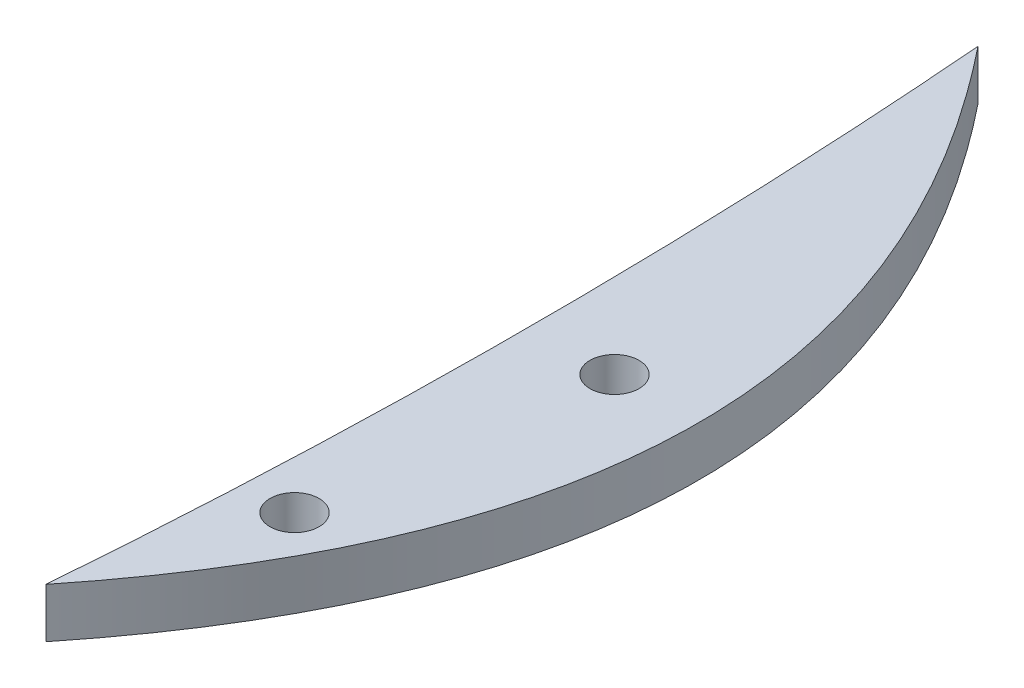
ISO-10303-21;
HEADER;
FILE_DESCRIPTION(('STEP AP214'),'2;1');
FILE_NAME('part.step','',(''),(''),'','','');
FILE_SCHEMA(('AUTOMOTIVE_DESIGN { 1 0 10303 214 1 1 1 1 }'));
ENDSEC;
DATA;
#1=APPLICATION_CONTEXT('core data for automotive mechanical design processes');
#2=APPLICATION_PROTOCOL_DEFINITION('international standard','automotive_design',2000,#1);
#3=PRODUCT_CONTEXT('',#1,'mechanical');
#4=PRODUCT('Part','Part','',(#3));
#5=PRODUCT_RELATED_PRODUCT_CATEGORY('part','',(#4));
#6=PRODUCT_DEFINITION_FORMATION('','',#4);
#7=PRODUCT_DEFINITION_CONTEXT('part definition',#1,'design');
#8=PRODUCT_DEFINITION('design','',#6,#7);
#9=PRODUCT_DEFINITION_SHAPE('','',#8);
#10=(LENGTH_UNIT() NAMED_UNIT(*) SI_UNIT(.MILLI.,.METRE.));
#11=(NAMED_UNIT(*) PLANE_ANGLE_UNIT() SI_UNIT($,.RADIAN.));
#12=(NAMED_UNIT(*) SI_UNIT($,.STERADIAN.) SOLID_ANGLE_UNIT());
#13=UNCERTAINTY_MEASURE_WITH_UNIT(LENGTH_MEASURE(1.E-05),#10,'distance_accuracy_value','');
#14=(GEOMETRIC_REPRESENTATION_CONTEXT(3) GLOBAL_UNCERTAINTY_ASSIGNED_CONTEXT((#13)) GLOBAL_UNIT_ASSIGNED_CONTEXT((#10,
#11,#12)) REPRESENTATION_CONTEXT('',''));
#15=CARTESIAN_POINT('',(0.,0.,0.));
#16=DIRECTION('',(0.,0.,1.));
#17=DIRECTION('',(1.,0.,0.));
#18=AXIS2_PLACEMENT_3D('',#15,#16,#17);
#19=CARTESIAN_POINT('',(-16.8339768339768,4.,19.8455598455599));
#20=CARTESIAN_POINT('',(13.1660231660232,4.,-17.6544401544401));
#21=CARTESIAN_POINT('',(-16.8339768339768,4.,-55.1544401544402));
#22=B_SPLINE_CURVE_WITH_KNOTS('',2,(#19,#20,#21),.UNSPECIFIED.,.F.,.F.,(3,3),(0.,1.),.UNSPECIFIED.);
#23=DIRECTION('',(0.,-1.,0.));
#24=VECTOR('',#23,1.);
#25=SURFACE_OF_LINEAR_EXTRUSION('',#22,#24);
#26=CARTESIAN_POINT('',(-16.8339768339768,0.,19.8455598455599));
#27=CARTESIAN_POINT('',(13.1660231660232,0.,-17.6544401544401));
#28=CARTESIAN_POINT('',(-16.8339768339768,0.,-55.1544401544402));
#29=B_SPLINE_CURVE_WITH_KNOTS('',2,(#26,#27,#28),.UNSPECIFIED.,.F.,.F.,(3,3),(0.,1.),.UNSPECIFIED.);
#30=CARTESIAN_POINT('',(-16.8339768339768,0.,19.8455598455599));
#31=VERTEX_POINT('',#30);
#32=CARTESIAN_POINT('',(-16.8339768339768,0.,-55.1544401544402));
#33=VERTEX_POINT('',#32);
#34=EDGE_CURVE('E65',#31,#33,#29,.T.);
#35=ORIENTED_EDGE('',*,*,#34,.T.);
#36=DIRECTION('',(0.,-1.,0.));
#37=VECTOR('',#36,1.);
#38=CARTESIAN_POINT('',(-16.8339768339768,4.,-55.1544401544402));
#39=LINE('',#38,#37);
#40=CARTESIAN_POINT('',(-16.8339768339768,4.,-55.1544401544402));
#41=VERTEX_POINT('',#40);
#42=EDGE_CURVE('E11',#41,#33,#39,.T.);
#43=ORIENTED_EDGE('',*,*,#42,.F.);
#44=CARTESIAN_POINT('',(-16.8339768339768,4.,19.8455598455599));
#45=VERTEX_POINT('',#44);
#46=EDGE_CURVE('E67',#45,#41,#22,.T.);
#47=ORIENTED_EDGE('',*,*,#46,.F.);
#48=DIRECTION('',(0.,-1.,0.));
#49=VECTOR('',#48,1.);
#50=CARTESIAN_POINT('',(-16.8339768339768,4.,19.8455598455599));
#51=LINE('',#50,#49);
#52=EDGE_CURVE('E49',#45,#31,#51,.T.);
#53=ORIENTED_EDGE('',*,*,#52,.T.);
#54=EDGE_LOOP('',(#35,#43,#47,#53));
#55=FACE_BOUND('',#54,.T.);
#56=ADVANCED_FACE('F39',(#55),#25,.F.);
#57=CARTESIAN_POINT('',(-16.8339768339768,4.,19.8455598455599));
#58=CARTESIAN_POINT('',(-13.8339768339768,4.,-17.6544401544401));
#59=CARTESIAN_POINT('',(-16.8339768339768,4.,-55.1544401544402));
#60=B_SPLINE_CURVE_WITH_KNOTS('',2,(#57,#58,#59),.UNSPECIFIED.,.F.,.F.,(3,3),(0.,1.),.UNSPECIFIED.);
#61=DIRECTION('',(0.,-1.,0.));
#62=VECTOR('',#61,1.);
#63=SURFACE_OF_LINEAR_EXTRUSION('',#60,#62);
#64=CARTESIAN_POINT('',(-16.8339768339768,0.,19.8455598455599));
#65=CARTESIAN_POINT('',(-13.8339768339768,0.,-17.6544401544401));
#66=CARTESIAN_POINT('',(-16.8339768339768,0.,-55.1544401544402));
#67=B_SPLINE_CURVE_WITH_KNOTS('',2,(#64,#65,#66),.UNSPECIFIED.,.F.,.F.,(3,3),(0.,1.),.UNSPECIFIED.);
#68=EDGE_CURVE('E73',#31,#33,#67,.T.);
#69=ORIENTED_EDGE('',*,*,#68,.F.);
#70=ORIENTED_EDGE('',*,*,#52,.F.);
#71=EDGE_CURVE('E70',#45,#41,#60,.T.);
#72=ORIENTED_EDGE('',*,*,#71,.T.);
#73=ORIENTED_EDGE('',*,*,#42,.T.);
#74=EDGE_LOOP('',(#69,#70,#72,#73));
#75=FACE_BOUND('',#74,.T.);
#76=ADVANCED_FACE('F77',(#75),#63,.T.);
#77=CARTESIAN_POINT('',(-1.83397683397684,4.,-17.6544401544401));
#78=DIRECTION('',(0.,-1.,0.));
#79=DIRECTION('',(0.,0.,-1.));
#80=AXIS2_PLACEMENT_3D('',#77,#78,#79);
#81=PLANE('',#80);
#82=CARTESIAN_POINT('',(-11.8339768339768,4.,4.84555984555985));
#83=DIRECTION('',(0.,1.,0.));
#84=DIRECTION('',(0.,0.,1.));
#85=AXIS2_PLACEMENT_3D('',#82,#83,#84);
#86=CIRCLE('',#85,1.975);
#87=CARTESIAN_POINT('',(-11.8339768339768,4.,6.82055984555985));
#88=VERTEX_POINT('',#87);
#89=EDGE_CURVE('E161',#88,#88,#86,.T.);
#90=ORIENTED_EDGE('',*,*,#89,.F.);
#91=EDGE_LOOP('',(#90));
#92=FACE_BOUND('',#91,.T.);
#93=CARTESIAN_POINT('',(-8.58397683396106,4.,-17.6544401374841));
#94=DIRECTION('',(0.,1.,0.));
#95=DIRECTION('',(0.,0.,1.));
#96=AXIS2_PLACEMENT_3D('',#93,#94,#95);
#97=CIRCLE('',#96,1.975);
#98=CARTESIAN_POINT('',(-8.58397683396106,4.,-15.6794401374841));
#99=VERTEX_POINT('',#98);
#100=EDGE_CURVE('E163',#99,#99,#97,.T.);
#101=ORIENTED_EDGE('',*,*,#100,.F.);
#102=EDGE_LOOP('',(#101));
#103=FACE_BOUND('',#102,.T.);
#104=ORIENTED_EDGE('',*,*,#46,.T.);
#105=ORIENTED_EDGE('',*,*,#71,.F.);
#106=EDGE_LOOP('',(#104,#105));
#107=FACE_BOUND('',#106,.T.);
#108=ADVANCED_FACE('F105',(#92,#103,#107),#81,.F.);
#109=CARTESIAN_POINT('',(-1.83397683397684,0.,-17.6544401544401));
#110=DIRECTION('',(0.,-1.,0.));
#111=DIRECTION('',(0.,0.,-1.));
#112=AXIS2_PLACEMENT_3D('',#109,#110,#111);
#113=PLANE('',#112);
#114=CARTESIAN_POINT('',(-11.8339768339768,0.,4.84555984555985));
#115=DIRECTION('',(0.,1.,0.));
#116=DIRECTION('',(0.,0.,1.));
#117=AXIS2_PLACEMENT_3D('',#114,#115,#116);
#118=CIRCLE('',#117,1.975);
#119=CARTESIAN_POINT('',(-11.8339768339768,0.,6.82055984555985));
#120=VERTEX_POINT('',#119);
#121=EDGE_CURVE('E75',#120,#120,#118,.T.);
#122=ORIENTED_EDGE('',*,*,#121,.T.);
#123=EDGE_LOOP('',(#122));
#124=FACE_BOUND('',#123,.T.);
#125=CARTESIAN_POINT('',(-8.58397683396106,0.,-17.6544401374841));
#126=DIRECTION('',(0.,1.,0.));
#127=DIRECTION('',(0.,0.,1.));
#128=AXIS2_PLACEMENT_3D('',#125,#126,#127);
#129=CIRCLE('',#128,1.975);
#130=CARTESIAN_POINT('',(-8.58397683396106,0.,-15.6794401374841));
#131=VERTEX_POINT('',#130);
#132=EDGE_CURVE('E169',#131,#131,#129,.T.);
#133=ORIENTED_EDGE('',*,*,#132,.T.);
#134=EDGE_LOOP('',(#133));
#135=FACE_BOUND('',#134,.T.);
#136=ORIENTED_EDGE('',*,*,#34,.F.);
#137=ORIENTED_EDGE('',*,*,#68,.T.);
#138=EDGE_LOOP('',(#136,#137));
#139=FACE_BOUND('',#138,.T.);
#140=ADVANCED_FACE('F72',(#124,#135,#139),#113,.T.);
#141=CARTESIAN_POINT('',(-8.58397683396106,0.,-17.6544401374841));
#142=DIRECTION('',(0.,1.,0.));
#143=DIRECTION('',(0.,0.,1.));
#144=AXIS2_PLACEMENT_3D('',#141,#142,#143);
#145=CYLINDRICAL_SURFACE('',#144,1.975);
#146=ORIENTED_EDGE('',*,*,#132,.F.);
#147=EDGE_LOOP('',(#146));
#148=FACE_BOUND('',#147,.T.);
#149=ORIENTED_EDGE('',*,*,#100,.T.);
#150=EDGE_LOOP('',(#149));
#151=FACE_BOUND('',#150,.T.);
#152=ADVANCED_FACE('F108',(#148,#151),#145,.F.);
#153=CARTESIAN_POINT('',(-11.8339768339768,0.,4.84555984555985));
#154=DIRECTION('',(0.,1.,0.));
#155=DIRECTION('',(0.,0.,1.));
#156=AXIS2_PLACEMENT_3D('',#153,#154,#155);
#157=CYLINDRICAL_SURFACE('',#156,1.975);
#158=ORIENTED_EDGE('',*,*,#121,.F.);
#159=EDGE_LOOP('',(#158));
#160=FACE_BOUND('',#159,.T.);
#161=ORIENTED_EDGE('',*,*,#89,.T.);
#162=EDGE_LOOP('',(#161));
#163=FACE_BOUND('',#162,.T.);
#164=ADVANCED_FACE('F115',(#160,#163),#157,.F.);
#165=CLOSED_SHELL('',(#56,#76,#108,#140,#152,#164));
#166=MANIFOLD_SOLID_BREP('B2',#165);
#167=ADVANCED_BREP_SHAPE_REPRESENTATION('',(#18,#166),#14);
#168=SHAPE_DEFINITION_REPRESENTATION(#9,#167);
ENDSEC;
END-ISO-10303-21;
